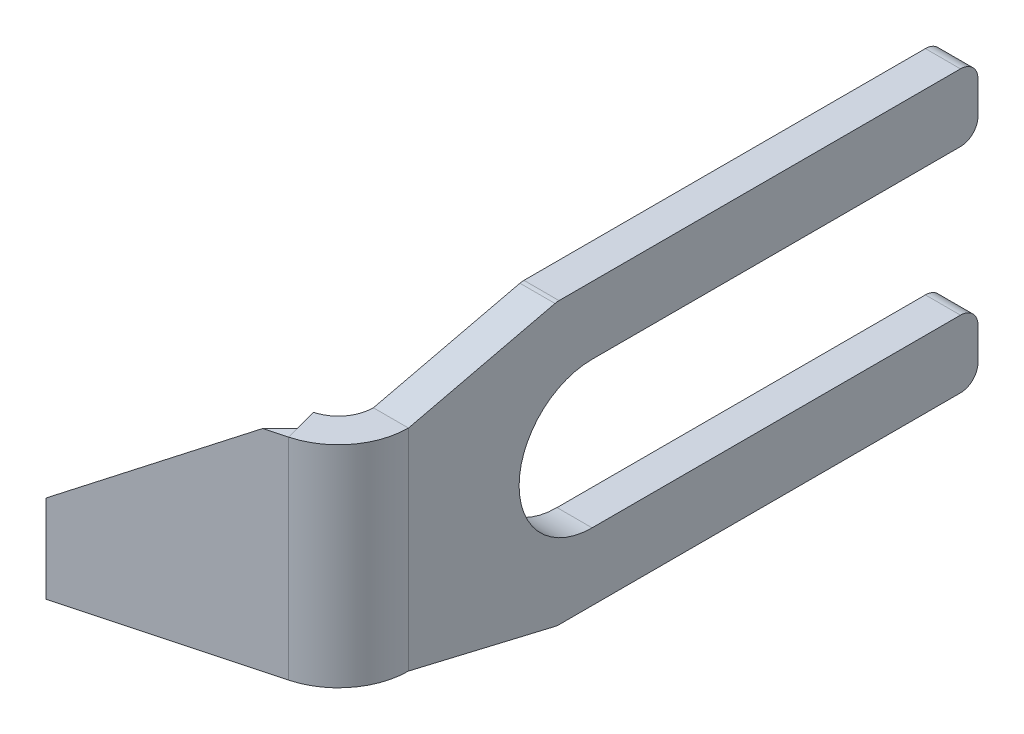
ISO-10303-21;
HEADER;
FILE_DESCRIPTION(('STEP AP214'),'2;1');
FILE_NAME('part.step','',(''),(''),'','','');
FILE_SCHEMA(('AUTOMOTIVE_DESIGN { 1 0 10303 214 1 1 1 1 }'));
ENDSEC;
DATA;
#1=APPLICATION_CONTEXT('core data for automotive mechanical design processes');
#2=APPLICATION_PROTOCOL_DEFINITION('international standard','automotive_design',2000,#1);
#3=PRODUCT_CONTEXT('',#1,'mechanical');
#4=PRODUCT('Part','Part','',(#3));
#5=PRODUCT_RELATED_PRODUCT_CATEGORY('part','',(#4));
#6=PRODUCT_DEFINITION_FORMATION('','',#4);
#7=PRODUCT_DEFINITION_CONTEXT('part definition',#1,'design');
#8=PRODUCT_DEFINITION('design','',#6,#7);
#9=PRODUCT_DEFINITION_SHAPE('','',#8);
#10=(LENGTH_UNIT() NAMED_UNIT(*) SI_UNIT(.MILLI.,.METRE.));
#11=(NAMED_UNIT(*) PLANE_ANGLE_UNIT() SI_UNIT($,.RADIAN.));
#12=(NAMED_UNIT(*) SI_UNIT($,.STERADIAN.) SOLID_ANGLE_UNIT());
#13=UNCERTAINTY_MEASURE_WITH_UNIT(LENGTH_MEASURE(1.E-05),#10,'distance_accuracy_value','');
#14=(GEOMETRIC_REPRESENTATION_CONTEXT(3) GLOBAL_UNCERTAINTY_ASSIGNED_CONTEXT((#13)) GLOBAL_UNIT_ASSIGNED_CONTEXT((#10,
#11,#12)) REPRESENTATION_CONTEXT('',''));
#15=CARTESIAN_POINT('',(0.,0.,0.));
#16=DIRECTION('',(0.,0.,1.));
#17=DIRECTION('',(1.,0.,0.));
#18=AXIS2_PLACEMENT_3D('',#15,#16,#17);
#19=CARTESIAN_POINT('',(-1.5875,4.7625,25.7693684065834));
#20=DIRECTION('',(0.,1.,0.));
#21=DIRECTION('',(1.,0.,0.));
#22=AXIS2_PLACEMENT_3D('',#19,#20,#21);
#23=PLANE('',#22);
#24=DIRECTION('',(-0.258819045102518,0.,-0.96592582628907));
#25=VECTOR('',#24,1.);
#26=CARTESIAN_POINT('',(-0.765749531799503,4.7625,28.8361829050511));
#27=LINE('',#26,#25);
#28=CARTESIAN_POINT('',(-0.765749531799503,4.7625,28.8361829050511));
#29=VERTEX_POINT('',#28);
#30=CARTESIAN_POINT('',(-0.907394282828808,4.7625,28.3075574975843));
#31=VERTEX_POINT('',#30);
#32=EDGE_CURVE('E251',#29,#31,#27,.T.);
#33=ORIENTED_EDGE('',*,*,#32,.T.);
#34=DIRECTION('',(0.710957016837406,0.,-0.703235465693858));
#35=VECTOR('',#34,1.);
#36=CARTESIAN_POINT('',(0.0178584422238087,4.7625,27.3923537432402));
#37=LINE('',#36,#35);
#38=CARTESIAN_POINT('',(-1.69301109144974,4.7625,29.0846418911319));
#39=VERTEX_POINT('',#38);
#40=EDGE_CURVE('E386',#39,#31,#37,.T.);
#41=ORIENTED_EDGE('',*,*,#40,.F.);
#42=DIRECTION('',(-0.965925826289069,0.,0.258819045102518));
#43=VECTOR('',#42,1.);
#44=CARTESIAN_POINT('',(0.410875234100251,4.7625,28.5209072492338));
#45=LINE('',#44,#43);
#46=EDGE_CURVE('E225',#29,#39,#45,.T.);
#47=ORIENTED_EDGE('',*,*,#46,.F.);
#48=EDGE_LOOP('',(#33,#41,#47));
#49=FACE_BOUND('',#48,.T.);
#50=ADVANCED_FACE('F40',(#49),#23,.T.);
#51=CARTESIAN_POINT('',(0.,4.7625,0.));
#52=DIRECTION('',(0.,0.,-1.));
#53=DIRECTION('',(-1.,0.,0.));
#54=AXIS2_PLACEMENT_3D('',#51,#52,#53);
#55=PLANE('',#54);
#56=DIRECTION('',(0.,-1.,0.));
#57=VECTOR('',#56,1.);
#58=CARTESIAN_POINT('',(1.5875,4.7625,0.));
#59=LINE('',#58,#57);
#60=CARTESIAN_POINT('',(1.5875,-4.09575,0.));
#61=VERTEX_POINT('',#60);
#62=CARTESIAN_POINT('',(1.5875,-5.55625000000001,-1.11022302462516E-13));
#63=VERTEX_POINT('',#62);
#64=EDGE_CURVE('E234',#61,#63,#59,.T.);
#65=ORIENTED_EDGE('',*,*,#64,.T.);
#66=DIRECTION('',(1.,0.,0.));
#67=VECTOR('',#66,1.);
#68=CARTESIAN_POINT('',(0.,-5.55625000000001,-1.11022302462516E-13));
#69=LINE('',#68,#67);
#70=CARTESIAN_POINT('',(0.,-5.55625000000001,-1.11022302462516E-13));
#71=VERTEX_POINT('',#70);
#72=EDGE_CURVE('E291',#63,#71,#69,.F.);
#73=ORIENTED_EDGE('',*,*,#72,.T.);
#74=DIRECTION('',(0.,-1.,0.));
#75=VECTOR('',#74,1.);
#76=CARTESIAN_POINT('',(0.,4.7625,0.));
#77=LINE('',#76,#75);
#78=CARTESIAN_POINT('',(0.,-4.09575,0.));
#79=VERTEX_POINT('',#78);
#80=EDGE_CURVE('E231',#79,#71,#77,.T.);
#81=ORIENTED_EDGE('',*,*,#80,.F.);
#82=DIRECTION('',(1.,0.,0.));
#83=VECTOR('',#82,1.);
#84=CARTESIAN_POINT('',(1.5875,-4.09575000000001,0.));
#85=LINE('',#84,#83);
#86=EDGE_CURVE('E288',#79,#61,#85,.T.);
#87=ORIENTED_EDGE('',*,*,#86,.T.);
#88=EDGE_LOOP('',(#65,#73,#81,#87));
#89=FACE_BOUND('',#88,.T.);
#90=ADVANCED_FACE('F434',(#89),#55,.T.);
#91=CARTESIAN_POINT('',(0.,4.7625,26.9874999999999));
#92=DIRECTION('',(0.258819045102518,0.,0.96592582628907));
#93=DIRECTION('',(0.965925826289069,0.,-0.258819045102518));
#94=AXIS2_PLACEMENT_3D('',#91,#92,#93);
#95=PLANE('',#94);
#96=DIRECTION('',(-0.965925826289069,0.,0.258819045102518));
#97=VECTOR('',#96,1.);
#98=CARTESIAN_POINT('',(0.,-4.76250000000001,26.9875));
#99=LINE('',#98,#97);
#100=CARTESIAN_POINT('',(-1.17662476589975,-4.76250000000002,27.3027756558172));
#101=VERTEX_POINT('',#100);
#102=CARTESIAN_POINT('',(-8.30493366185077,-4.76250000000001,29.2128002678869));
#103=VERTEX_POINT('',#102);
#104=EDGE_CURVE('E201',#101,#103,#99,.T.);
#105=ORIENTED_EDGE('',*,*,#104,.T.);
#106=DIRECTION('',(0.,-1.,0.));
#107=VECTOR('',#106,1.);
#108=CARTESIAN_POINT('',(-8.30493366185077,6.34999999999999,29.2128002678869));
#109=LINE('',#108,#107);
#110=CARTESIAN_POINT('',(-8.30493366185077,-1.62443859130362,29.2128002678869));
#111=VERTEX_POINT('',#110);
#112=EDGE_CURVE('E186',#111,#103,#109,.T.);
#113=ORIENTED_EDGE('',*,*,#112,.F.);
#114=DIRECTION('',(-0.793585441894478,-0.570093089663073,0.212640578280719));
#115=VECTOR('',#114,1.);
#116=CARTESIAN_POINT('',(-9.83834091108468,-2.72600224189255,29.6236755019871));
#117=LINE('',#116,#115);
#118=CARTESIAN_POINT('',(-1.17662476589974,3.49637062221248,27.3027756558172));
#119=VERTEX_POINT('',#118);
#120=EDGE_CURVE('E383',#119,#111,#117,.T.);
#121=ORIENTED_EDGE('',*,*,#120,.F.);
#122=DIRECTION('',(0.,-1.,0.));
#123=VECTOR('',#122,1.);
#124=CARTESIAN_POINT('',(-1.17662476589975,4.7625,27.3027756558172));
#125=LINE('',#124,#123);
#126=EDGE_CURVE('E207',#119,#101,#125,.T.);
#127=ORIENTED_EDGE('',*,*,#126,.T.);
#128=EDGE_LOOP('',(#105,#113,#121,#127));
#129=FACE_BOUND('',#128,.T.);
#130=ADVANCED_FACE('F205',(#129),#95,.F.);
#131=CARTESIAN_POINT('',(0.410875234100251,4.7625,28.5209072492338));
#132=DIRECTION('',(0.258819045102518,0.,0.96592582628907));
#133=DIRECTION('',(0.965925826289069,0.,-0.258819045102518));
#134=AXIS2_PLACEMENT_3D('',#131,#132,#133);
#135=PLANE('',#134);
#136=ORIENTED_EDGE('',*,*,#46,.T.);
#137=DIRECTION('',(0.793585441894478,0.570093089663073,-0.212640578280719));
#138=VECTOR('',#137,1.);
#139=CARTESIAN_POINT('',(-0.272900720381435,5.78267384186409,28.704124464041));
#140=LINE('',#139,#138);
#141=CARTESIAN_POINT('',(-9.42746567698445,-0.793750000000003,31.157082751221));
#142=VERTEX_POINT('',#141);
#143=EDGE_CURVE('E209',#142,#39,#140,.T.);
#144=ORIENTED_EDGE('',*,*,#143,.F.);
#145=DIRECTION('',(0.,-1.,0.));
#146=VECTOR('',#145,1.);
#147=CARTESIAN_POINT('',(-9.42746567698444,4.7625,31.1570827512211));
#148=LINE('',#147,#146);
#149=CARTESIAN_POINT('',(-9.42746567698444,-4.76250000000001,31.157082751221));
#150=VERTEX_POINT('',#149);
#151=EDGE_CURVE('E244',#142,#150,#148,.T.);
#152=ORIENTED_EDGE('',*,*,#151,.T.);
#153=DIRECTION('',(-0.965925826289069,0.,0.258819045102518));
#154=VECTOR('',#153,1.);
#155=CARTESIAN_POINT('',(0.410875234100251,-4.76250000000001,28.5209072492339));
#156=LINE('',#155,#154);
#157=CARTESIAN_POINT('',(-0.765749531799503,-4.76250000000001,28.8361829050511));
#158=VERTEX_POINT('',#157);
#159=EDGE_CURVE('E203',#158,#150,#156,.T.);
#160=ORIENTED_EDGE('',*,*,#159,.F.);
#161=DIRECTION('',(0.,-1.,0.));
#162=VECTOR('',#161,1.);
#163=CARTESIAN_POINT('',(-0.765749531799503,4.7625,28.8361829050511));
#164=LINE('',#163,#162);
#165=EDGE_CURVE('E241',#29,#158,#164,.T.);
#166=ORIENTED_EDGE('',*,*,#165,.F.);
#167=EDGE_LOOP('',(#136,#144,#152,#160,#166));
#168=FACE_BOUND('',#167,.T.);
#169=ADVANCED_FACE('F422',(#168),#135,.T.);
#170=CARTESIAN_POINT('',(0.,4.7625,25.7693684065834));
#171=DIRECTION('',(0.,1.,0.));
#172=DIRECTION('',(0.,0.,1.));
#173=AXIS2_PLACEMENT_3D('',#170,#171,#172);
#174=PLANE('',#173);
#175=DIRECTION('',(1.,0.,0.));
#176=VECTOR('',#175,1.);
#177=CARTESIAN_POINT('',(0.,4.7625,25.7693684065834));
#178=LINE('',#177,#176);
#179=CARTESIAN_POINT('',(0.,4.7625,25.7693684065834));
#180=VERTEX_POINT('',#179);
#181=CARTESIAN_POINT('',(1.5875,4.7625,25.7693684065834));
#182=VERTEX_POINT('',#181);
#183=EDGE_CURVE('E254',#180,#182,#178,.T.);
#184=ORIENTED_EDGE('',*,*,#183,.F.);
#185=CARTESIAN_POINT('',(-1.5875,4.7625,25.7693684065834));
#186=DIRECTION('',(0.,1.,0.));
#187=DIRECTION('',(0.,0.,1.));
#188=AXIS2_PLACEMENT_3D('',#185,#186,#187);
#189=CIRCLE('',#188,1.5875);
#190=CARTESIAN_POINT('',(-1.17662476589975,4.7625,27.3027756558172));
#191=VERTEX_POINT('',#190);
#192=EDGE_CURVE('E217',#180,#191,#189,.F.);
#193=ORIENTED_EDGE('',*,*,#192,.T.);
#194=DIRECTION('',(-0.258819045102518,0.,-0.96592582628907));
#195=VECTOR('',#194,1.);
#196=CARTESIAN_POINT('',(-0.604849140016933,4.7625,29.4366713421415));
#197=LINE('',#196,#195);
#198=EDGE_CURVE('E376',#31,#191,#197,.T.);
#199=ORIENTED_EDGE('',*,*,#198,.F.);
#200=ORIENTED_EDGE('',*,*,#32,.F.);
#201=CARTESIAN_POINT('',(-1.5875,4.7625,25.7693684065834));
#202=DIRECTION('',(0.,1.,0.));
#203=DIRECTION('',(1.,0.,0.));
#204=AXIS2_PLACEMENT_3D('',#201,#202,#203);
#205=CIRCLE('',#204,3.175);
#206=EDGE_CURVE('E364',#182,#29,#205,.F.);
#207=ORIENTED_EDGE('',*,*,#206,.F.);
#208=EDGE_LOOP('',(#184,#193,#199,#200,#207));
#209=FACE_BOUND('',#208,.T.);
#210=ADVANCED_FACE('F375',(#209),#174,.T.);
#211=CARTESIAN_POINT('',(-1.17662476589975,-4.76250000000002,27.3027756558172));
#212=DIRECTION('',(0.,-1.,0.));
#213=DIRECTION('',(0.,0.,-1.));
#214=AXIS2_PLACEMENT_3D('',#211,#212,#213);
#215=PLANE('',#214);
#216=DIRECTION('',(0.258819045102518,0.,0.96592582628907));
#217=VECTOR('',#216,1.);
#218=CARTESIAN_POINT('',(-1.17662476589975,-4.76250000000002,27.3027756558172));
#219=LINE('',#218,#217);
#220=EDGE_CURVE('E249',#101,#158,#219,.T.);
#221=ORIENTED_EDGE('',*,*,#220,.F.);
#222=CARTESIAN_POINT('',(-1.5875,-4.76250000000001,25.7693684065834));
#223=DIRECTION('',(0.,1.,0.));
#224=DIRECTION('',(0.,0.,1.));
#225=AXIS2_PLACEMENT_3D('',#222,#223,#224);
#226=CIRCLE('',#225,1.5875);
#227=CARTESIAN_POINT('',(0.,-4.76250000000001,25.7693684065834));
#228=VERTEX_POINT('',#227);
#229=EDGE_CURVE('E222',#228,#101,#226,.F.);
#230=ORIENTED_EDGE('',*,*,#229,.F.);
#231=DIRECTION('',(-1.,0.,0.));
#232=VECTOR('',#231,1.);
#233=CARTESIAN_POINT('',(1.5875,-4.76250000000001,25.7693684065834));
#234=LINE('',#233,#232);
#235=CARTESIAN_POINT('',(1.58750000000001,-4.76250000000001,25.7693684065834));
#236=VERTEX_POINT('',#235);
#237=EDGE_CURVE('E246',#236,#228,#234,.T.);
#238=ORIENTED_EDGE('',*,*,#237,.F.);
#239=CARTESIAN_POINT('',(-1.5875,-4.76250000000001,25.7693684065834));
#240=DIRECTION('',(0.,1.,0.));
#241=DIRECTION('',(1.,0.,0.));
#242=AXIS2_PLACEMENT_3D('',#239,#240,#241);
#243=CIRCLE('',#242,3.175);
#244=EDGE_CURVE('E211',#236,#158,#243,.F.);
#245=ORIENTED_EDGE('',*,*,#244,.T.);
#246=EDGE_LOOP('',(#221,#230,#238,#245));
#247=FACE_BOUND('',#246,.T.);
#248=ADVANCED_FACE('F411',(#247),#215,.T.);
#249=CARTESIAN_POINT('',(1.5875,-4.76250000000001,25.7693684065834));
#250=DIRECTION('',(0.,-1.,0.));
#251=DIRECTION('',(0.,0.,-1.));
#252=AXIS2_PLACEMENT_3D('',#249,#250,#251);
#253=PLANE('',#252);
#254=DIRECTION('',(-0.500000000000008,0.,0.866025403784434));
#255=VECTOR('',#254,1.);
#256=CARTESIAN_POINT('',(-9.42746567698444,-4.76250000000001,31.157082751221));
#257=LINE('',#256,#255);
#258=EDGE_CURVE('E189',#103,#150,#257,.T.);
#259=ORIENTED_EDGE('',*,*,#258,.F.);
#260=ORIENTED_EDGE('',*,*,#104,.F.);
#261=ORIENTED_EDGE('',*,*,#220,.T.);
#262=ORIENTED_EDGE('',*,*,#159,.T.);
#263=EDGE_LOOP('',(#259,#260,#261,#262));
#264=FACE_BOUND('',#263,.T.);
#265=ADVANCED_FACE('F200',(#264),#253,.T.);
#266=CARTESIAN_POINT('',(-1.5875,4.7625,25.7693684065834));
#267=DIRECTION('',(0.,-1.,0.));
#268=DIRECTION('',(0.,0.,-1.));
#269=AXIS2_PLACEMENT_3D('',#266,#267,#268);
#270=CYLINDRICAL_SURFACE('',#269,3.175);
#271=ORIENTED_EDGE('',*,*,#244,.F.);
#272=DIRECTION('',(0.,-1.,0.));
#273=VECTOR('',#272,1.);
#274=CARTESIAN_POINT('',(1.5875,4.7625,25.7693684065834));
#275=LINE('',#274,#273);
#276=EDGE_CURVE('E238',#182,#236,#275,.T.);
#277=ORIENTED_EDGE('',*,*,#276,.F.);
#278=ORIENTED_EDGE('',*,*,#206,.T.);
#279=ORIENTED_EDGE('',*,*,#165,.T.);
#280=EDGE_LOOP('',(#271,#277,#278,#279));
#281=FACE_BOUND('',#280,.T.);
#282=ADVANCED_FACE('F417',(#281),#270,.T.);
#283=CARTESIAN_POINT('',(1.5875,4.7625,0.));
#284=DIRECTION('',(1.,0.,0.));
#285=DIRECTION('',(0.,0.,-1.));
#286=AXIS2_PLACEMENT_3D('',#283,#284,#285);
#287=PLANE('',#286);
#288=DIRECTION('',(0.,-0.229927463379789,-0.973207768970088));
#289=VECTOR('',#288,1.);
#290=CARTESIAN_POINT('',(1.58750000000001,-4.76250000000001,25.7693684065834));
#291=LINE('',#290,#289);
#292=CARTESIAN_POINT('',(1.5875,-6.32873366662003,19.1400134353621));
#293=VERTEX_POINT('',#292);
#294=EDGE_CURVE('E385',#236,#293,#291,.T.);
#295=ORIENTED_EDGE('',*,*,#294,.T.);
#296=CARTESIAN_POINT('',(1.5875,-5.55625000000001,18.9575085113043));
#297=DIRECTION('',(1.,0.,0.));
#298=DIRECTION('',(0.,0.,-1.));
#299=AXIS2_PLACEMENT_3D('',#296,#297,#298);
#300=CIRCLE('',#299,0.79375);
#301=CARTESIAN_POINT('',(1.5875,-6.35000000000002,18.9575085113044));
#302=VERTEX_POINT('',#301);
#303=EDGE_CURVE('E270',#293,#302,#300,.T.);
#304=ORIENTED_EDGE('',*,*,#303,.T.);
#305=DIRECTION('',(0.,0.,-1.));
#306=VECTOR('',#305,1.);
#307=CARTESIAN_POINT('',(1.5875,-6.35000000000002,0.));
#308=LINE('',#307,#306);
#309=CARTESIAN_POINT('',(1.5875,-6.35000000000001,0.793749999999913));
#310=VERTEX_POINT('',#309);
#311=EDGE_CURVE('E388',#302,#310,#308,.T.);
#312=ORIENTED_EDGE('',*,*,#311,.T.);
#313=CARTESIAN_POINT('',(1.5875,-5.55625000000001,0.793749999999982));
#314=DIRECTION('',(1.,0.,0.));
#315=DIRECTION('',(0.,0.,-1.));
#316=AXIS2_PLACEMENT_3D('',#313,#314,#315);
#317=CIRCLE('',#316,0.79375);
#318=EDGE_CURVE('E268',#310,#63,#317,.T.);
#319=ORIENTED_EDGE('',*,*,#318,.T.);
#320=ORIENTED_EDGE('',*,*,#64,.F.);
#321=CARTESIAN_POINT('',(1.5875,-4.09575000000001,0.793749999999926));
#322=DIRECTION('',(1.,0.,0.));
#323=DIRECTION('',(0.,0.,-1.));
#324=AXIS2_PLACEMENT_3D('',#321,#322,#323);
#325=CIRCLE('',#324,0.79375);
#326=CARTESIAN_POINT('',(1.5875,-3.302,0.793749999999926));
#327=VERTEX_POINT('',#326);
#328=EDGE_CURVE('E264',#61,#327,#325,.T.);
#329=ORIENTED_EDGE('',*,*,#328,.T.);
#330=DIRECTION('',(0.,0.,-1.));
#331=VECTOR('',#330,1.);
#332=CARTESIAN_POINT('',(1.5875,-3.30200000000001,0.));
#333=LINE('',#332,#331);
#334=CARTESIAN_POINT('',(1.5875,-3.30200000000002,17.4625));
#335=VERTEX_POINT('',#334);
#336=EDGE_CURVE('E355',#335,#327,#333,.T.);
#337=ORIENTED_EDGE('',*,*,#336,.F.);
#338=CARTESIAN_POINT('',(1.5875,0.,17.4625));
#339=DIRECTION('',(1.,0.,0.));
#340=DIRECTION('',(0.,0.,-1.));
#341=AXIS2_PLACEMENT_3D('',#338,#339,#340);
#342=CIRCLE('',#341,3.302);
#343=CARTESIAN_POINT('',(1.5875,3.302,17.4624999999999));
#344=VERTEX_POINT('',#343);
#345=EDGE_CURVE('E320',#344,#335,#342,.T.);
#346=ORIENTED_EDGE('',*,*,#345,.F.);
#347=DIRECTION('',(0.,0.,1.));
#348=VECTOR('',#347,1.);
#349=CARTESIAN_POINT('',(1.5875,3.302,0.));
#350=LINE('',#349,#348);
#351=CARTESIAN_POINT('',(1.5875,3.30199999999999,0.793749999999926));
#352=VERTEX_POINT('',#351);
#353=EDGE_CURVE('E309',#352,#344,#350,.T.);
#354=ORIENTED_EDGE('',*,*,#353,.F.);
#355=CARTESIAN_POINT('',(1.5875,4.09574999999999,0.793749999999913));
#356=DIRECTION('',(1.,0.,0.));
#357=DIRECTION('',(0.,0.,-1.));
#358=AXIS2_PLACEMENT_3D('',#355,#356,#357);
#359=CIRCLE('',#358,0.79375);
#360=CARTESIAN_POINT('',(1.5875,4.09574999999999,0.));
#361=VERTEX_POINT('',#360);
#362=EDGE_CURVE('E262',#352,#361,#359,.T.);
#363=ORIENTED_EDGE('',*,*,#362,.T.);
#364=CARTESIAN_POINT('',(1.5875,5.55624999999999,0.));
#365=VERTEX_POINT('',#364);
#366=EDGE_CURVE('E237',#365,#361,#59,.T.);
#367=ORIENTED_EDGE('',*,*,#366,.F.);
#368=CARTESIAN_POINT('',(1.5875,5.55625,0.793749999999926));
#369=DIRECTION('',(1.,0.,0.));
#370=DIRECTION('',(0.,0.,-1.));
#371=AXIS2_PLACEMENT_3D('',#368,#369,#370);
#372=CIRCLE('',#371,0.79375);
#373=CARTESIAN_POINT('',(1.5875,6.34999999999999,0.793749999999926));
#374=VERTEX_POINT('',#373);
#375=EDGE_CURVE('E260',#365,#374,#372,.T.);
#376=ORIENTED_EDGE('',*,*,#375,.T.);
#377=DIRECTION('',(0.,0.,1.));
#378=VECTOR('',#377,1.);
#379=CARTESIAN_POINT('',(1.58750000000001,6.34999999999999,19.05));
#380=LINE('',#379,#378);
#381=CARTESIAN_POINT('',(1.58750000000001,6.34999999999999,18.9575085113044));
#382=VERTEX_POINT('',#381);
#383=EDGE_CURVE('E338',#374,#382,#380,.T.);
#384=ORIENTED_EDGE('',*,*,#383,.T.);
#385=CARTESIAN_POINT('',(1.58750000000001,5.55625,18.9575085113043));
#386=DIRECTION('',(1.,0.,0.));
#387=DIRECTION('',(0.,0.,-1.));
#388=AXIS2_PLACEMENT_3D('',#385,#386,#387);
#389=CIRCLE('',#388,0.79375);
#390=CARTESIAN_POINT('',(1.58750000000001,6.32873366662001,19.1400134353621));
#391=VERTEX_POINT('',#390);
#392=EDGE_CURVE('E266',#382,#391,#389,.T.);
#393=ORIENTED_EDGE('',*,*,#392,.T.);
#394=DIRECTION('',(0.,-0.229927463379789,0.973207768970089));
#395=VECTOR('',#394,1.);
#396=CARTESIAN_POINT('',(1.58750000000001,4.7625,25.7693684065834));
#397=LINE('',#396,#395);
#398=EDGE_CURVE('E343',#391,#182,#397,.T.);
#399=ORIENTED_EDGE('',*,*,#398,.T.);
#400=ORIENTED_EDGE('',*,*,#276,.T.);
#401=EDGE_LOOP('',(#295,#304,#312,#319,#320,#329,#337,#346,#354,#363,#367,#376,#384,#393,#399,#400));
#402=FACE_BOUND('',#401,.T.);
#403=ADVANCED_FACE('F315',(#402),#287,.T.);
#404=ORIENTED_EDGE('',*,*,#366,.T.);
#405=DIRECTION('',(-1.,0.,0.));
#406=VECTOR('',#405,1.);
#407=CARTESIAN_POINT('',(0.,4.09574999999999,0.));
#408=LINE('',#407,#406);
#409=CARTESIAN_POINT('',(0.,4.09574999999999,0.));
#410=VERTEX_POINT('',#409);
#411=EDGE_CURVE('E305',#361,#410,#408,.T.);
#412=ORIENTED_EDGE('',*,*,#411,.T.);
#413=CARTESIAN_POINT('',(0.,5.55624999999999,0.));
#414=VERTEX_POINT('',#413);
#415=EDGE_CURVE('E232',#414,#410,#77,.T.);
#416=ORIENTED_EDGE('',*,*,#415,.F.);
#417=DIRECTION('',(1.,0.,0.));
#418=VECTOR('',#417,1.);
#419=CARTESIAN_POINT('',(0.,5.55624999999999,0.));
#420=LINE('',#419,#418);
#421=EDGE_CURVE('E302',#414,#365,#420,.T.);
#422=ORIENTED_EDGE('',*,*,#421,.T.);
#423=EDGE_LOOP('',(#404,#412,#416,#422));
#424=FACE_BOUND('',#423,.T.);
#425=ADVANCED_FACE('F326',(#424),#55,.T.);
#426=CARTESIAN_POINT('',(0.,4.7625,0.));
#427=DIRECTION('',(1.,0.,0.));
#428=DIRECTION('',(0.,0.,-1.));
#429=AXIS2_PLACEMENT_3D('',#426,#427,#428);
#430=PLANE('',#429);
#431=DIRECTION('',(0.,0.,-1.));
#432=VECTOR('',#431,1.);
#433=CARTESIAN_POINT('',(0.,-6.35000000000002,0.));
#434=LINE('',#433,#432);
#435=CARTESIAN_POINT('',(0.,-6.35000000000002,18.9575085113044));
#436=VERTEX_POINT('',#435);
#437=CARTESIAN_POINT('',(0.,-6.35000000000001,0.793749999999913));
#438=VERTEX_POINT('',#437);
#439=EDGE_CURVE('E346',#436,#438,#434,.T.);
#440=ORIENTED_EDGE('',*,*,#439,.F.);
#441=CARTESIAN_POINT('',(0.,-5.55625000000001,18.9575085113043));
#442=DIRECTION('',(1.,0.,0.));
#443=DIRECTION('',(0.,0.,-1.));
#444=AXIS2_PLACEMENT_3D('',#441,#442,#443);
#445=CIRCLE('',#444,0.79375);
#446=CARTESIAN_POINT('',(0.,-6.32873366662003,19.1400134353621));
#447=VERTEX_POINT('',#446);
#448=EDGE_CURVE('E286',#436,#447,#445,.F.);
#449=ORIENTED_EDGE('',*,*,#448,.T.);
#450=DIRECTION('',(0.,-0.229927463379789,-0.973207768970088));
#451=VECTOR('',#450,1.);
#452=CARTESIAN_POINT('',(0.,-4.76250000000001,25.7693684065834));
#453=LINE('',#452,#451);
#454=EDGE_CURVE('E393',#228,#447,#453,.T.);
#455=ORIENTED_EDGE('',*,*,#454,.F.);
#456=DIRECTION('',(0.,-1.,0.));
#457=VECTOR('',#456,1.);
#458=CARTESIAN_POINT('',(0.,4.7625,25.7693684065834));
#459=LINE('',#458,#457);
#460=EDGE_CURVE('E229',#180,#228,#459,.T.);
#461=ORIENTED_EDGE('',*,*,#460,.F.);
#462=DIRECTION('',(0.,-0.229927463379789,0.973207768970089));
#463=VECTOR('',#462,1.);
#464=CARTESIAN_POINT('',(0.,4.7625,25.7693684065834));
#465=LINE('',#464,#463);
#466=CARTESIAN_POINT('',(0.,6.32873366662001,19.1400134353621));
#467=VERTEX_POINT('',#466);
#468=EDGE_CURVE('E342',#467,#180,#465,.T.);
#469=ORIENTED_EDGE('',*,*,#468,.F.);
#470=CARTESIAN_POINT('',(0.,5.55625,18.9575085113043));
#471=DIRECTION('',(1.,0.,0.));
#472=DIRECTION('',(0.,0.,-1.));
#473=AXIS2_PLACEMENT_3D('',#470,#471,#472);
#474=CIRCLE('',#473,0.79375);
#475=CARTESIAN_POINT('',(0.,6.34999999999999,18.9575085113044));
#476=VERTEX_POINT('',#475);
#477=EDGE_CURVE('E282',#467,#476,#474,.F.);
#478=ORIENTED_EDGE('',*,*,#477,.T.);
#479=DIRECTION('',(0.,0.,1.));
#480=VECTOR('',#479,1.);
#481=CARTESIAN_POINT('',(0.,6.34999999999999,19.05));
#482=LINE('',#481,#480);
#483=CARTESIAN_POINT('',(0.,6.34999999999999,0.793749999999926));
#484=VERTEX_POINT('',#483);
#485=EDGE_CURVE('E333',#484,#476,#482,.T.);
#486=ORIENTED_EDGE('',*,*,#485,.F.);
#487=CARTESIAN_POINT('',(0.,5.55625,0.793749999999926));
#488=DIRECTION('',(1.,0.,0.));
#489=DIRECTION('',(0.,0.,-1.));
#490=AXIS2_PLACEMENT_3D('',#487,#488,#489);
#491=CIRCLE('',#490,0.79375);
#492=EDGE_CURVE('E277',#484,#414,#491,.F.);
#493=ORIENTED_EDGE('',*,*,#492,.T.);
#494=ORIENTED_EDGE('',*,*,#415,.T.);
#495=CARTESIAN_POINT('',(0.,4.09574999999999,0.793749999999913));
#496=DIRECTION('',(1.,0.,0.));
#497=DIRECTION('',(0.,0.,-1.));
#498=AXIS2_PLACEMENT_3D('',#495,#496,#497);
#499=CIRCLE('',#498,0.79375);
#500=CARTESIAN_POINT('',(0.,3.30199999999999,0.793749999999926));
#501=VERTEX_POINT('',#500);
#502=EDGE_CURVE('E55',#410,#501,#499,.F.);
#503=ORIENTED_EDGE('',*,*,#502,.T.);
#504=DIRECTION('',(0.,0.,-1.));
#505=VECTOR('',#504,1.);
#506=CARTESIAN_POINT('',(0.,3.302,0.));
#507=LINE('',#506,#505);
#508=CARTESIAN_POINT('',(0.,3.302,17.4624999999999));
#509=VERTEX_POINT('',#508);
#510=EDGE_CURVE('E214',#509,#501,#507,.T.);
#511=ORIENTED_EDGE('',*,*,#510,.F.);
#512=CARTESIAN_POINT('',(0.,0.,17.4625));
#513=DIRECTION('',(1.,0.,0.));
#514=DIRECTION('',(0.,0.,-1.));
#515=AXIS2_PLACEMENT_3D('',#512,#513,#514);
#516=CIRCLE('',#515,3.302);
#517=CARTESIAN_POINT('',(0.,-3.30200000000002,17.4625));
#518=VERTEX_POINT('',#517);
#519=EDGE_CURVE('E350',#518,#509,#516,.F.);
#520=ORIENTED_EDGE('',*,*,#519,.F.);
#521=DIRECTION('',(0.,0.,1.));
#522=VECTOR('',#521,1.);
#523=CARTESIAN_POINT('',(0.,-3.30200000000001,0.));
#524=LINE('',#523,#522);
#525=CARTESIAN_POINT('',(0.,-3.302,0.793749999999926));
#526=VERTEX_POINT('',#525);
#527=EDGE_CURVE('E321',#526,#518,#524,.T.);
#528=ORIENTED_EDGE('',*,*,#527,.F.);
#529=CARTESIAN_POINT('',(0.,-4.09575000000001,0.793749999999926));
#530=DIRECTION('',(1.,0.,0.));
#531=DIRECTION('',(0.,0.,-1.));
#532=AXIS2_PLACEMENT_3D('',#529,#530,#531);
#533=CIRCLE('',#532,0.79375);
#534=EDGE_CURVE('E280',#526,#79,#533,.F.);
#535=ORIENTED_EDGE('',*,*,#534,.T.);
#536=ORIENTED_EDGE('',*,*,#80,.T.);
#537=CARTESIAN_POINT('',(0.,-5.55625000000001,0.793749999999968));
#538=DIRECTION('',(1.,0.,0.));
#539=DIRECTION('',(0.,0.,-1.));
#540=AXIS2_PLACEMENT_3D('',#537,#538,#539);
#541=CIRCLE('',#540,0.79375);
#542=EDGE_CURVE('E284',#71,#438,#541,.F.);
#543=ORIENTED_EDGE('',*,*,#542,.T.);
#544=EDGE_LOOP('',(#440,#449,#455,#461,#469,#478,#486,#493,#494,#503,#511,#520,#528,#535,#536,#543));
#545=FACE_BOUND('',#544,.T.);
#546=ADVANCED_FACE('F329',(#545),#430,.F.);
#547=CARTESIAN_POINT('',(-1.5875,4.7625,25.7693684065834));
#548=DIRECTION('',(0.,-1.,0.));
#549=DIRECTION('',(0.,0.,-1.));
#550=AXIS2_PLACEMENT_3D('',#547,#548,#549);
#551=CYLINDRICAL_SURFACE('',#550,1.5875);
#552=ORIENTED_EDGE('',*,*,#229,.T.);
#553=ORIENTED_EDGE('',*,*,#126,.F.);
#554=EDGE_CURVE('E226',#191,#119,#125,.T.);
#555=ORIENTED_EDGE('',*,*,#554,.F.);
#556=ORIENTED_EDGE('',*,*,#192,.F.);
#557=ORIENTED_EDGE('',*,*,#460,.T.);
#558=EDGE_LOOP('',(#552,#553,#555,#556,#557));
#559=FACE_BOUND('',#558,.T.);
#560=ADVANCED_FACE('F379',(#559),#551,.F.);
#561=CARTESIAN_POINT('',(-9.83934091108469,-3.30200000000001,0.));
#562=DIRECTION('',(0.,-1.,0.));
#563=DIRECTION('',(0.,0.,-1.));
#564=AXIS2_PLACEMENT_3D('',#561,#562,#563);
#565=PLANE('',#564);
#566=ORIENTED_EDGE('',*,*,#336,.T.);
#567=DIRECTION('',(1.,0.,0.));
#568=VECTOR('',#567,1.);
#569=CARTESIAN_POINT('',(0.,-3.302,0.793749999999926));
#570=LINE('',#569,#568);
#571=EDGE_CURVE('E300',#327,#526,#570,.F.);
#572=ORIENTED_EDGE('',*,*,#571,.T.);
#573=ORIENTED_EDGE('',*,*,#527,.T.);
#574=DIRECTION('',(1.,0.,0.));
#575=VECTOR('',#574,1.);
#576=CARTESIAN_POINT('',(-9.83934091108469,-3.30200000000002,17.4625));
#577=LINE('',#576,#575);
#578=EDGE_CURVE('E359',#518,#335,#577,.T.);
#579=ORIENTED_EDGE('',*,*,#578,.T.);
#580=EDGE_LOOP('',(#566,#572,#573,#579));
#581=FACE_BOUND('',#580,.T.);
#582=ADVANCED_FACE('F446',(#581),#565,.F.);
#583=CARTESIAN_POINT('',(-9.83934091108469,0.,17.4625));
#584=DIRECTION('',(1.,0.,0.));
#585=DIRECTION('',(0.,0.,-1.));
#586=AXIS2_PLACEMENT_3D('',#583,#584,#585);
#587=CYLINDRICAL_SURFACE('',#586,3.302);
#588=ORIENTED_EDGE('',*,*,#519,.T.);
#589=DIRECTION('',(1.,0.,0.));
#590=VECTOR('',#589,1.);
#591=CARTESIAN_POINT('',(-9.83934091108469,3.302,17.4624999999999));
#592=LINE('',#591,#590);
#593=EDGE_CURVE('E358',#509,#344,#592,.T.);
#594=ORIENTED_EDGE('',*,*,#593,.T.);
#595=ORIENTED_EDGE('',*,*,#345,.T.);
#596=ORIENTED_EDGE('',*,*,#578,.F.);
#597=EDGE_LOOP('',(#588,#594,#595,#596));
#598=FACE_BOUND('',#597,.T.);
#599=ADVANCED_FACE('F605',(#598),#587,.F.);
#600=CARTESIAN_POINT('',(-9.83934091108469,3.302,0.));
#601=DIRECTION('',(0.,1.,0.));
#602=DIRECTION('',(0.,0.,1.));
#603=AXIS2_PLACEMENT_3D('',#600,#601,#602);
#604=PLANE('',#603);
#605=ORIENTED_EDGE('',*,*,#510,.T.);
#606=DIRECTION('',(-1.,0.,0.));
#607=VECTOR('',#606,1.);
#608=CARTESIAN_POINT('',(1.5875,3.30199999999999,0.793749999999926));
#609=LINE('',#608,#607);
#610=EDGE_CURVE('E48',#501,#352,#609,.F.);
#611=ORIENTED_EDGE('',*,*,#610,.T.);
#612=ORIENTED_EDGE('',*,*,#353,.T.);
#613=ORIENTED_EDGE('',*,*,#593,.F.);
#614=EDGE_LOOP('',(#605,#611,#612,#613));
#615=FACE_BOUND('',#614,.T.);
#616=ADVANCED_FACE('F308',(#615),#604,.F.);
#617=CARTESIAN_POINT('',(0.,4.7625,25.7693684065834));
#618=DIRECTION('',(0.,0.973207768970089,0.229927463379789));
#619=DIRECTION('',(0.,-0.229927463379789,0.973207768970089));
#620=AXIS2_PLACEMENT_3D('',#617,#618,#619);
#621=PLANE('',#620);
#622=ORIENTED_EDGE('',*,*,#398,.F.);
#623=DIRECTION('',(1.,0.,0.));
#624=VECTOR('',#623,1.);
#625=CARTESIAN_POINT('',(0.,6.32873366662001,19.1400134353621));
#626=LINE('',#625,#624);
#627=EDGE_CURVE('E298',#391,#467,#626,.F.);
#628=ORIENTED_EDGE('',*,*,#627,.T.);
#629=ORIENTED_EDGE('',*,*,#468,.T.);
#630=ORIENTED_EDGE('',*,*,#183,.T.);
#631=EDGE_LOOP('',(#622,#628,#629,#630));
#632=FACE_BOUND('',#631,.T.);
#633=ADVANCED_FACE('F405',(#632),#621,.T.);
#634=CARTESIAN_POINT('',(0.,6.34999999999999,19.05));
#635=DIRECTION('',(0.,1.,0.));
#636=DIRECTION('',(0.,0.,1.));
#637=AXIS2_PLACEMENT_3D('',#634,#635,#636);
#638=PLANE('',#637);
#639=ORIENTED_EDGE('',*,*,#485,.T.);
#640=DIRECTION('',(1.,0.,0.));
#641=VECTOR('',#640,1.);
#642=CARTESIAN_POINT('',(0.,6.34999999999999,18.9575085113044));
#643=LINE('',#642,#641);
#644=EDGE_CURVE('E295',#476,#382,#643,.T.);
#645=ORIENTED_EDGE('',*,*,#644,.T.);
#646=ORIENTED_EDGE('',*,*,#383,.F.);
#647=DIRECTION('',(1.,0.,0.));
#648=VECTOR('',#647,1.);
#649=CARTESIAN_POINT('',(0.,6.34999999999999,0.793749999999926));
#650=LINE('',#649,#648);
#651=EDGE_CURVE('E293',#374,#484,#650,.F.);
#652=ORIENTED_EDGE('',*,*,#651,.T.);
#653=EDGE_LOOP('',(#639,#645,#646,#652));
#654=FACE_BOUND('',#653,.T.);
#655=ADVANCED_FACE('F340',(#654),#638,.T.);
#656=CARTESIAN_POINT('',(0.,-6.35000000000002,0.));
#657=DIRECTION('',(0.,-1.,0.));
#658=DIRECTION('',(0.,0.,-1.));
#659=AXIS2_PLACEMENT_3D('',#656,#657,#658);
#660=PLANE('',#659);
#661=ORIENTED_EDGE('',*,*,#311,.F.);
#662=DIRECTION('',(1.,0.,0.));
#663=VECTOR('',#662,1.);
#664=CARTESIAN_POINT('',(0.,-6.35000000000002,18.9575085113044));
#665=LINE('',#664,#663);
#666=EDGE_CURVE('E275',#302,#436,#665,.F.);
#667=ORIENTED_EDGE('',*,*,#666,.T.);
#668=ORIENTED_EDGE('',*,*,#439,.T.);
#669=DIRECTION('',(1.,0.,0.));
#670=VECTOR('',#669,1.);
#671=CARTESIAN_POINT('',(0.,-6.35000000000001,0.793749999999913));
#672=LINE('',#671,#670);
#673=EDGE_CURVE('E272',#438,#310,#672,.T.);
#674=ORIENTED_EDGE('',*,*,#673,.T.);
#675=EDGE_LOOP('',(#661,#667,#668,#674));
#676=FACE_BOUND('',#675,.T.);
#677=ADVANCED_FACE('F641',(#676),#660,.T.);
#678=CARTESIAN_POINT('',(0.,-4.76250000000001,25.7693684065834));
#679=DIRECTION('',(0.,-0.973207768970088,0.229927463379789));
#680=DIRECTION('',(0.,-0.229927463379789,-0.973207768970088));
#681=AXIS2_PLACEMENT_3D('',#678,#679,#680);
#682=PLANE('',#681);
#683=ORIENTED_EDGE('',*,*,#454,.T.);
#684=DIRECTION('',(1.,0.,0.));
#685=VECTOR('',#684,1.);
#686=CARTESIAN_POINT('',(0.,-6.32873366662003,19.1400134353621));
#687=LINE('',#686,#685);
#688=EDGE_CURVE('E257',#447,#293,#687,.T.);
#689=ORIENTED_EDGE('',*,*,#688,.T.);
#690=ORIENTED_EDGE('',*,*,#294,.F.);
#691=ORIENTED_EDGE('',*,*,#237,.T.);
#692=EDGE_LOOP('',(#683,#689,#690,#691));
#693=FACE_BOUND('',#692,.T.);
#694=ADVANCED_FACE('F414',(#693),#682,.T.);
#695=CARTESIAN_POINT('',(0.,-5.55625000000001,18.9575085113043));
#696=DIRECTION('',(1.,0.,0.));
#697=DIRECTION('',(0.,0.,-1.));
#698=AXIS2_PLACEMENT_3D('',#695,#696,#697);
#699=CYLINDRICAL_SURFACE('',#698,0.79375);
#700=ORIENTED_EDGE('',*,*,#448,.F.);
#701=ORIENTED_EDGE('',*,*,#666,.F.);
#702=ORIENTED_EDGE('',*,*,#303,.F.);
#703=ORIENTED_EDGE('',*,*,#688,.F.);
#704=EDGE_LOOP('',(#700,#701,#702,#703));
#705=FACE_BOUND('',#704,.T.);
#706=ADVANCED_FACE('F464',(#705),#699,.T.);
#707=CARTESIAN_POINT('',(0.,-5.55625000000001,0.793749999999968));
#708=DIRECTION('',(1.,0.,0.));
#709=DIRECTION('',(0.,0.,-1.));
#710=AXIS2_PLACEMENT_3D('',#707,#708,#709);
#711=CYLINDRICAL_SURFACE('',#710,0.79375);
#712=ORIENTED_EDGE('',*,*,#542,.F.);
#713=ORIENTED_EDGE('',*,*,#72,.F.);
#714=ORIENTED_EDGE('',*,*,#318,.F.);
#715=ORIENTED_EDGE('',*,*,#673,.F.);
#716=EDGE_LOOP('',(#712,#713,#714,#715));
#717=FACE_BOUND('',#716,.T.);
#718=ADVANCED_FACE('F467',(#717),#711,.T.);
#719=CARTESIAN_POINT('',(0.,5.55625,18.9575085113043));
#720=DIRECTION('',(1.,0.,0.));
#721=DIRECTION('',(0.,0.,-1.));
#722=AXIS2_PLACEMENT_3D('',#719,#720,#721);
#723=CYLINDRICAL_SURFACE('',#722,0.79375);
#724=ORIENTED_EDGE('',*,*,#477,.F.);
#725=ORIENTED_EDGE('',*,*,#627,.F.);
#726=ORIENTED_EDGE('',*,*,#392,.F.);
#727=ORIENTED_EDGE('',*,*,#644,.F.);
#728=EDGE_LOOP('',(#724,#725,#726,#727));
#729=FACE_BOUND('',#728,.T.);
#730=ADVANCED_FACE('F401',(#729),#723,.T.);
#731=CARTESIAN_POINT('',(0.,-4.09575000000001,0.793749999999926));
#732=DIRECTION('',(-1.,0.,0.));
#733=DIRECTION('',(0.,0.,1.));
#734=AXIS2_PLACEMENT_3D('',#731,#732,#733);
#735=CYLINDRICAL_SURFACE('',#734,0.79375);
#736=ORIENTED_EDGE('',*,*,#534,.F.);
#737=ORIENTED_EDGE('',*,*,#571,.F.);
#738=ORIENTED_EDGE('',*,*,#328,.F.);
#739=ORIENTED_EDGE('',*,*,#86,.F.);
#740=EDGE_LOOP('',(#736,#737,#738,#739));
#741=FACE_BOUND('',#740,.T.);
#742=ADVANCED_FACE('F474',(#741),#735,.T.);
#743=CARTESIAN_POINT('',(0.,4.09574999999999,0.793749999999913));
#744=DIRECTION('',(1.,0.,0.));
#745=DIRECTION('',(0.,0.,-1.));
#746=AXIS2_PLACEMENT_3D('',#743,#744,#745);
#747=CYLINDRICAL_SURFACE('',#746,0.79375);
#748=ORIENTED_EDGE('',*,*,#362,.F.);
#749=ORIENTED_EDGE('',*,*,#610,.F.);
#750=ORIENTED_EDGE('',*,*,#502,.F.);
#751=ORIENTED_EDGE('',*,*,#411,.F.);
#752=EDGE_LOOP('',(#748,#749,#750,#751));
#753=FACE_BOUND('',#752,.T.);
#754=ADVANCED_FACE('F323',(#753),#747,.T.);
#755=CARTESIAN_POINT('',(0.,5.55625,0.793749999999926));
#756=DIRECTION('',(1.,0.,0.));
#757=DIRECTION('',(0.,0.,-1.));
#758=AXIS2_PLACEMENT_3D('',#755,#756,#757);
#759=CYLINDRICAL_SURFACE('',#758,0.79375);
#760=ORIENTED_EDGE('',*,*,#492,.F.);
#761=ORIENTED_EDGE('',*,*,#651,.F.);
#762=ORIENTED_EDGE('',*,*,#375,.F.);
#763=ORIENTED_EDGE('',*,*,#421,.F.);
#764=EDGE_LOOP('',(#760,#761,#762,#763));
#765=FACE_BOUND('',#764,.T.);
#766=ADVANCED_FACE('F42',(#765),#759,.T.);
#767=CARTESIAN_POINT('',(-4.1035858516801,-18.8698548009126,7.74412318850243));
#768=DIRECTION('',(0.572393523393076,-0.580944863613758,0.578678425222898));
#769=DIRECTION('',(0.,-0.705723420720677,-0.70848744057062));
#770=AXIS2_PLACEMENT_3D('',#767,#768,#769);
#771=PLANE('',#770);
#772=ORIENTED_EDGE('',*,*,#120,.T.);
#773=DIRECTION('',(-0.468929908475992,0.347014356686893,0.812210426669025));
#774=VECTOR('',#773,1.);
#775=CARTESIAN_POINT('',(3.60196014469139,-10.4356980561665,8.58945523462916));
#776=LINE('',#775,#774);
#777=EDGE_CURVE('E11',#111,#142,#776,.T.);
#778=ORIENTED_EDGE('',*,*,#777,.T.);
#779=ORIENTED_EDGE('',*,*,#143,.T.);
#780=ORIENTED_EDGE('',*,*,#40,.T.);
#781=DIRECTION('',(-0.164300745418645,-0.772668823359507,-0.613178729623846));
#782=VECTOR('',#781,1.);
#783=CARTESIAN_POINT('',(-0.785473767002054,5.33586429769204,28.7625710571349));
#784=LINE('',#783,#782);
#785=EDGE_CURVE('E195',#31,#119,#784,.T.);
#786=ORIENTED_EDGE('',*,*,#785,.T.);
#787=EDGE_LOOP('',(#772,#778,#779,#780,#786));
#788=FACE_BOUND('',#787,.T.);
#789=ADVANCED_FACE('F424',(#788),#771,.F.);
#790=CARTESIAN_POINT('',(-0.604849140016933,4.7625,29.4366713421415));
#791=DIRECTION('',(0.965925826289069,0.,-0.258819045102518));
#792=DIRECTION('',(-0.258819045102518,0.,-0.96592582628907));
#793=AXIS2_PLACEMENT_3D('',#790,#791,#792);
#794=PLANE('',#793);
#795=ORIENTED_EDGE('',*,*,#198,.T.);
#796=ORIENTED_EDGE('',*,*,#554,.T.);
#797=ORIENTED_EDGE('',*,*,#785,.F.);
#798=EDGE_LOOP('',(#795,#796,#797));
#799=FACE_BOUND('',#798,.T.);
#800=ADVANCED_FACE('F382',(#799),#794,.F.);
#801=CARTESIAN_POINT('',(-9.42746567698444,6.35,31.157082751221));
#802=DIRECTION('',(0.866025403784434,0.,0.500000000000008));
#803=DIRECTION('',(0.500000000000008,0.,-0.866025403784435));
#804=AXIS2_PLACEMENT_3D('',#801,#802,#803);
#805=PLANE('',#804);
#806=ORIENTED_EDGE('',*,*,#112,.T.);
#807=ORIENTED_EDGE('',*,*,#258,.T.);
#808=ORIENTED_EDGE('',*,*,#151,.F.);
#809=ORIENTED_EDGE('',*,*,#777,.F.);
#810=EDGE_LOOP('',(#806,#807,#808,#809));
#811=FACE_BOUND('',#810,.T.);
#812=ADVANCED_FACE('F188',(#811),#805,.F.);
#813=CLOSED_SHELL('',(#50,#90,#130,#169,#210,#248,#265,#282,#403,#425,#546,#560,#582,#599,#616,
#633,#655,#677,#694,#706,#718,#730,#742,#754,#766,#789,#800,#812));
#814=MANIFOLD_SOLID_BREP('B2',#813);
#815=ADVANCED_BREP_SHAPE_REPRESENTATION('',(#18,#814),#14);
#816=SHAPE_DEFINITION_REPRESENTATION(#9,#815);
ENDSEC;
END-ISO-10303-21;
